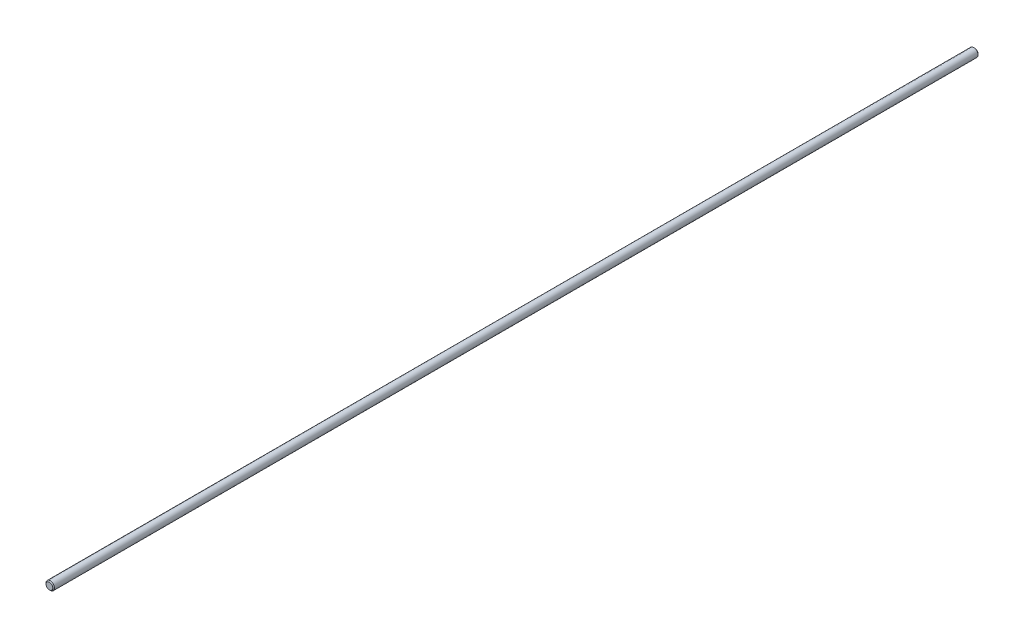
ISO-10303-21;
HEADER;
FILE_DESCRIPTION(('STEP AP214'),'2;1');
FILE_NAME('part.step','',(''),(''),'','','');
FILE_SCHEMA(('AUTOMOTIVE_DESIGN { 1 0 10303 214 1 1 1 1 }'));
ENDSEC;
DATA;
#1=APPLICATION_CONTEXT('core data for automotive mechanical design processes');
#2=APPLICATION_PROTOCOL_DEFINITION('international standard','automotive_design',2000,#1);
#3=PRODUCT_CONTEXT('',#1,'mechanical');
#4=PRODUCT('Part','Part','',(#3));
#5=PRODUCT_RELATED_PRODUCT_CATEGORY('part','',(#4));
#6=PRODUCT_DEFINITION_FORMATION('','',#4);
#7=PRODUCT_DEFINITION_CONTEXT('part definition',#1,'design');
#8=PRODUCT_DEFINITION('design','',#6,#7);
#9=PRODUCT_DEFINITION_SHAPE('','',#8);
#10=(LENGTH_UNIT() NAMED_UNIT(*) SI_UNIT(.MILLI.,.METRE.));
#11=(NAMED_UNIT(*) PLANE_ANGLE_UNIT() SI_UNIT($,.RADIAN.));
#12=(NAMED_UNIT(*) SI_UNIT($,.STERADIAN.) SOLID_ANGLE_UNIT());
#13=UNCERTAINTY_MEASURE_WITH_UNIT(LENGTH_MEASURE(1.E-05),#10,'distance_accuracy_value','');
#14=(GEOMETRIC_REPRESENTATION_CONTEXT(3) GLOBAL_UNCERTAINTY_ASSIGNED_CONTEXT((#13)) GLOBAL_UNIT_ASSIGNED_CONTEXT((#10,
#11,#12)) REPRESENTATION_CONTEXT('',''));
#15=CARTESIAN_POINT('',(0.,0.,0.));
#16=DIRECTION('',(0.,0.,1.));
#17=DIRECTION('',(1.,0.,0.));
#18=AXIS2_PLACEMENT_3D('',#15,#16,#17);
#19=CARTESIAN_POINT('',(0.,0.,1093.));
#20=DIRECTION('',(0.,0.,-1.));
#21=DIRECTION('',(-1.,0.,0.));
#22=AXIS2_PLACEMENT_3D('',#19,#20,#21);
#23=CYLINDRICAL_SURFACE('',#22,5.);
#24=CARTESIAN_POINT('',(0.,0.,0.99999999999989));
#25=DIRECTION('',(0.,0.,1.));
#26=DIRECTION('',(1.,0.,0.));
#27=AXIS2_PLACEMENT_3D('',#24,#25,#26);
#28=CIRCLE('',#27,5.);
#29=CARTESIAN_POINT('',(5.,0.,0.99999999999989));
#30=VERTEX_POINT('',#29);
#31=EDGE_CURVE('E45',#30,#30,#28,.T.);
#32=ORIENTED_EDGE('',*,*,#31,.T.);
#33=EDGE_LOOP('',(#32));
#34=FACE_BOUND('',#33,.T.);
#35=CARTESIAN_POINT('',(0.,0.,1092.));
#36=DIRECTION('',(0.,0.,1.));
#37=DIRECTION('',(1.,0.,0.));
#38=AXIS2_PLACEMENT_3D('',#35,#36,#37);
#39=CIRCLE('',#38,5.);
#40=CARTESIAN_POINT('',(5.,0.,1092.));
#41=VERTEX_POINT('',#40);
#42=EDGE_CURVE('E49',#41,#41,#39,.F.);
#43=ORIENTED_EDGE('',*,*,#42,.T.);
#44=EDGE_LOOP('',(#43));
#45=FACE_BOUND('',#44,.T.);
#46=ADVANCED_FACE('F33',(#34,#45),#23,.T.);
#47=CARTESIAN_POINT('',(0.,0.,1093.));
#48=DIRECTION('',(0.,0.,1.));
#49=DIRECTION('',(1.,0.,0.));
#50=AXIS2_PLACEMENT_3D('',#47,#48,#49);
#51=PLANE('',#50);
#52=CARTESIAN_POINT('',(0.,0.,1093.));
#53=DIRECTION('',(0.,0.,1.));
#54=DIRECTION('',(1.,0.,0.));
#55=AXIS2_PLACEMENT_3D('',#52,#53,#54);
#56=CIRCLE('',#55,4.00000000000034);
#57=CARTESIAN_POINT('',(4.00000000000034,0.,1093.));
#58=VERTEX_POINT('',#57);
#59=EDGE_CURVE('E10',#58,#58,#56,.T.);
#60=ORIENTED_EDGE('',*,*,#59,.T.);
#61=EDGE_LOOP('',(#60));
#62=FACE_BOUND('',#61,.T.);
#63=ADVANCED_FACE('F65',(#62),#51,.T.);
#64=CARTESIAN_POINT('',(0.,0.,0.));
#65=DIRECTION('',(0.,0.,1.));
#66=DIRECTION('',(1.,0.,0.));
#67=AXIS2_PLACEMENT_3D('',#64,#65,#66);
#68=PLANE('',#67);
#69=CARTESIAN_POINT('',(0.,0.,0.));
#70=DIRECTION('',(0.,0.,1.));
#71=DIRECTION('',(1.,0.,0.));
#72=AXIS2_PLACEMENT_3D('',#69,#70,#71);
#73=CIRCLE('',#72,4.);
#74=CARTESIAN_POINT('',(4.,0.,0.));
#75=VERTEX_POINT('',#74);
#76=EDGE_CURVE('E41',#75,#75,#73,.F.);
#77=ORIENTED_EDGE('',*,*,#76,.T.);
#78=EDGE_LOOP('',(#77));
#79=FACE_BOUND('',#78,.T.);
#80=ADVANCED_FACE('F62',(#79),#68,.F.);
#81=CARTESIAN_POINT('',(0.,0.,0.99999999999989));
#82=DIRECTION('',(0.,0.,1.));
#83=DIRECTION('',(1.,0.,0.));
#84=AXIS2_PLACEMENT_3D('',#81,#82,#83);
#85=CONICAL_SURFACE('',#84,5.,0.785398163397502);
#86=ORIENTED_EDGE('',*,*,#76,.F.);
#87=EDGE_LOOP('',(#86));
#88=FACE_BOUND('',#87,.T.);
#89=ORIENTED_EDGE('',*,*,#31,.F.);
#90=EDGE_LOOP('',(#89));
#91=FACE_BOUND('',#90,.T.);
#92=ADVANCED_FACE('F58',(#88,#91),#85,.T.);
#93=CARTESIAN_POINT('',(0.,0.,1093.));
#94=DIRECTION('',(0.,0.,-1.));
#95=DIRECTION('',(-1.,0.,0.));
#96=AXIS2_PLACEMENT_3D('',#93,#94,#95);
#97=CONICAL_SURFACE('',#96,4.00000000000034,0.785398163397446);
#98=ORIENTED_EDGE('',*,*,#42,.F.);
#99=EDGE_LOOP('',(#98));
#100=FACE_BOUND('',#99,.T.);
#101=ORIENTED_EDGE('',*,*,#59,.F.);
#102=EDGE_LOOP('',(#101));
#103=FACE_BOUND('',#102,.T.);
#104=ADVANCED_FACE('F36',(#100,#103),#97,.T.);
#105=CLOSED_SHELL('',(#46,#63,#80,#92,#104));
#106=MANIFOLD_SOLID_BREP('B2',#105);
#107=ADVANCED_BREP_SHAPE_REPRESENTATION('',(#18,#106),#14);
#108=SHAPE_DEFINITION_REPRESENTATION(#9,#107);
ENDSEC;
END-ISO-10303-21;
